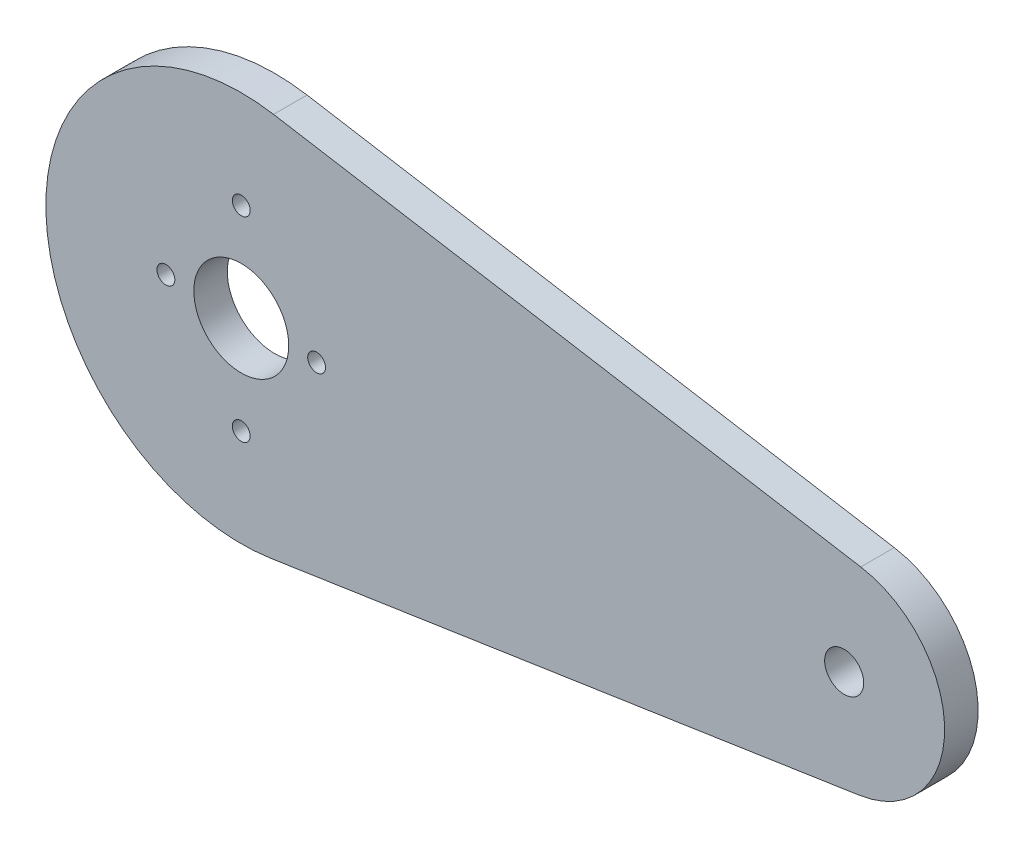
ISO-10303-21;
HEADER;
FILE_DESCRIPTION(('STEP AP214'),'2;1');
FILE_NAME('part.step','',(''),(''),'','','');
FILE_SCHEMA(('AUTOMOTIVE_DESIGN { 1 0 10303 214 1 1 1 1 }'));
ENDSEC;
DATA;
#1=APPLICATION_CONTEXT('core data for automotive mechanical design processes');
#2=APPLICATION_PROTOCOL_DEFINITION('international standard','automotive_design',2000,#1);
#3=PRODUCT_CONTEXT('',#1,'mechanical');
#4=PRODUCT('Part','Part','',(#3));
#5=PRODUCT_RELATED_PRODUCT_CATEGORY('part','',(#4));
#6=PRODUCT_DEFINITION_FORMATION('','',#4);
#7=PRODUCT_DEFINITION_CONTEXT('part definition',#1,'design');
#8=PRODUCT_DEFINITION('design','',#6,#7);
#9=PRODUCT_DEFINITION_SHAPE('','',#8);
#10=(LENGTH_UNIT() NAMED_UNIT(*) SI_UNIT(.MILLI.,.METRE.));
#11=(NAMED_UNIT(*) PLANE_ANGLE_UNIT() SI_UNIT($,.RADIAN.));
#12=(NAMED_UNIT(*) SI_UNIT($,.STERADIAN.) SOLID_ANGLE_UNIT());
#13=UNCERTAINTY_MEASURE_WITH_UNIT(LENGTH_MEASURE(1.E-05),#10,'distance_accuracy_value','');
#14=(GEOMETRIC_REPRESENTATION_CONTEXT(3) GLOBAL_UNCERTAINTY_ASSIGNED_CONTEXT((#13)) GLOBAL_UNIT_ASSIGNED_CONTEXT((#10,
#11,#12)) REPRESENTATION_CONTEXT('',''));
#15=CARTESIAN_POINT('',(0.,0.,0.));
#16=DIRECTION('',(0.,0.,1.));
#17=DIRECTION('',(1.,0.,0.));
#18=AXIS2_PLACEMENT_3D('',#15,#16,#17);
#19=CARTESIAN_POINT('',(-20.22,57.5800000000001,-3.));
#20=DIRECTION('',(0.,0.,1.));
#21=DIRECTION('',(1.,0.,0.));
#22=AXIS2_PLACEMENT_3D('',#19,#20,#21);
#23=CYLINDRICAL_SURFACE('',#22,17.4999999999997);
#24=CARTESIAN_POINT('',(-20.22,57.5800000000001,0.));
#25=DIRECTION('',(0.,0.,1.));
#26=DIRECTION('',(1.,0.,0.));
#27=AXIS2_PLACEMENT_3D('',#24,#25,#26);
#28=CIRCLE('',#27,17.4999999999997);
#29=CARTESIAN_POINT('',(-17.3295648934931,74.8396461404939,0.));
#30=VERTEX_POINT('',#29);
#31=CARTESIAN_POINT('',(-17.6013461685661,40.2770334303304,0.));
#32=VERTEX_POINT('',#31);
#33=EDGE_CURVE('E98',#30,#32,#28,.T.);
#34=ORIENTED_EDGE('',*,*,#33,.F.);
#35=DIRECTION('',(0.,0.,1.));
#36=VECTOR('',#35,1.);
#37=CARTESIAN_POINT('',(-17.3295648934931,74.8396461404939,-3.));
#38=LINE('',#37,#36);
#39=CARTESIAN_POINT('',(-17.3295648934931,74.8396461404939,-3.));
#40=VERTEX_POINT('',#39);
#41=EDGE_CURVE('E11',#40,#30,#38,.T.);
#42=ORIENTED_EDGE('',*,*,#41,.F.);
#43=CARTESIAN_POINT('',(-20.22,57.5800000000001,-3.));
#44=DIRECTION('',(0.,0.,1.));
#45=DIRECTION('',(1.,0.,0.));
#46=AXIS2_PLACEMENT_3D('',#43,#44,#45);
#47=CIRCLE('',#46,17.4999999999997);
#48=CARTESIAN_POINT('',(-17.6013461685661,40.2770334303304,-3.));
#49=VERTEX_POINT('',#48);
#50=EDGE_CURVE('E91',#40,#49,#47,.T.);
#51=ORIENTED_EDGE('',*,*,#50,.T.);
#52=DIRECTION('',(0.,0.,1.));
#53=VECTOR('',#52,1.);
#54=CARTESIAN_POINT('',(-17.6013461685661,40.2770334303304,-3.));
#55=LINE('',#54,#53);
#56=EDGE_CURVE('E36',#49,#32,#55,.T.);
#57=ORIENTED_EDGE('',*,*,#56,.T.);
#58=EDGE_LOOP('',(#34,#42,#51,#57));
#59=FACE_BOUND('',#58,.T.);
#60=ADVANCED_FACE('F33',(#59),#23,.T.);
#61=CARTESIAN_POINT('',(-17.3295648934931,74.8396461404939,-3.));
#62=DIRECTION('',(0.165167720371825,0.986265493742519,0.));
#63=DIRECTION('',(-0.986265493742519,0.165167720371825,0.));
#64=AXIS2_PLACEMENT_3D('',#61,#62,#63);
#65=PLANE('',#64);
#66=DIRECTION('',(-0.986265493742519,0.165167720371825,0.));
#67=VECTOR('',#66,1.);
#68=CARTESIAN_POINT('',(-17.3295648934931,74.8396461404939,0.));
#69=LINE('',#68,#67);
#70=CARTESIAN_POINT('',(35.2648400481839,66.0317764303149,0.));
#71=VERTEX_POINT('',#70);
#72=EDGE_CURVE('E93',#71,#30,#69,.T.);
#73=ORIENTED_EDGE('',*,*,#72,.F.);
#74=DIRECTION('',(0.,0.,1.));
#75=VECTOR('',#74,1.);
#76=CARTESIAN_POINT('',(35.2648400481839,66.0317764303149,-3.));
#77=LINE('',#76,#75);
#78=CARTESIAN_POINT('',(35.2648400481839,66.0317764303149,-3.));
#79=VERTEX_POINT('',#78);
#80=EDGE_CURVE('E42',#79,#71,#77,.T.);
#81=ORIENTED_EDGE('',*,*,#80,.F.);
#82=DIRECTION('',(-0.986265493742519,0.165167720371825,0.));
#83=VECTOR('',#82,1.);
#84=CARTESIAN_POINT('',(-17.3295648934931,74.8396461404939,-3.));
#85=LINE('',#84,#83);
#86=EDGE_CURVE('E88',#79,#40,#85,.T.);
#87=ORIENTED_EDGE('',*,*,#86,.T.);
#88=ORIENTED_EDGE('',*,*,#41,.T.);
#89=EDGE_LOOP('',(#73,#81,#87,#88));
#90=FACE_BOUND('',#89,.T.);
#91=ADVANCED_FACE('F109',(#90),#65,.T.);
#92=CARTESIAN_POINT('',(33.7783305648375,57.1553869866323,-3.));
#93=DIRECTION('',(0.,0.,1.));
#94=DIRECTION('',(1.,0.,0.));
#95=AXIS2_PLACEMENT_3D('',#92,#93,#94);
#96=CYLINDRICAL_SURFACE('',#95,8.99999999999999);
#97=CARTESIAN_POINT('',(33.7783305648375,57.1553869866323,0.));
#98=DIRECTION('',(0.,0.,1.));
#99=DIRECTION('',(-1.,0.,0.));
#100=AXIS2_PLACEMENT_3D('',#97,#98,#99);
#101=CIRCLE('',#100,8.99999999999999);
#102=CARTESIAN_POINT('',(35.1250668210035,48.2567184650877,0.));
#103=VERTEX_POINT('',#102);
#104=EDGE_CURVE('E83',#103,#71,#101,.T.);
#105=ORIENTED_EDGE('',*,*,#104,.F.);
#106=DIRECTION('',(0.,0.,1.));
#107=VECTOR('',#106,1.);
#108=CARTESIAN_POINT('',(35.1250668210035,48.2567184650877,-3.));
#109=LINE('',#108,#107);
#110=CARTESIAN_POINT('',(35.1250668210035,48.2567184650877,-3.));
#111=VERTEX_POINT('',#110);
#112=EDGE_CURVE('E78',#111,#103,#109,.T.);
#113=ORIENTED_EDGE('',*,*,#112,.F.);
#114=CARTESIAN_POINT('',(33.7783305648375,57.1553869866323,-3.));
#115=DIRECTION('',(0.,0.,1.));
#116=DIRECTION('',(-1.,0.,0.));
#117=AXIS2_PLACEMENT_3D('',#114,#115,#116);
#118=CIRCLE('',#117,8.99999999999999);
#119=EDGE_CURVE('E81',#111,#79,#118,.T.);
#120=ORIENTED_EDGE('',*,*,#119,.T.);
#121=ORIENTED_EDGE('',*,*,#80,.T.);
#122=EDGE_LOOP('',(#105,#113,#120,#121));
#123=FACE_BOUND('',#122,.T.);
#124=ADVANCED_FACE('F80',(#123),#96,.T.);
#125=CARTESIAN_POINT('',(-17.6013461685661,40.2770334303304,-3.));
#126=DIRECTION('',(0.149637361796223,-0.988740946838284,0.));
#127=DIRECTION('',(0.988740946838284,0.149637361796223,0.));
#128=AXIS2_PLACEMENT_3D('',#125,#126,#127);
#129=PLANE('',#128);
#130=DIRECTION('',(0.988740946838284,0.149637361796223,0.));
#131=VECTOR('',#130,1.);
#132=CARTESIAN_POINT('',(-17.6013461685661,40.2770334303304,0.));
#133=LINE('',#132,#131);
#134=EDGE_CURVE('E101',#32,#103,#133,.T.);
#135=ORIENTED_EDGE('',*,*,#134,.F.);
#136=ORIENTED_EDGE('',*,*,#56,.F.);
#137=DIRECTION('',(0.988740946838284,0.149637361796223,0.));
#138=VECTOR('',#137,1.);
#139=CARTESIAN_POINT('',(-17.6013461685661,40.2770334303304,-3.));
#140=LINE('',#139,#138);
#141=EDGE_CURVE('E87',#49,#111,#140,.T.);
#142=ORIENTED_EDGE('',*,*,#141,.T.);
#143=ORIENTED_EDGE('',*,*,#112,.T.);
#144=EDGE_LOOP('',(#135,#136,#142,#143));
#145=FACE_BOUND('',#144,.T.);
#146=ADVANCED_FACE('F90',(#145),#129,.T.);
#147=CARTESIAN_POINT('',(-20.22,57.5800000000001,-3.));
#148=DIRECTION('',(0.,0.,1.));
#149=DIRECTION('',(1.,0.,0.));
#150=AXIS2_PLACEMENT_3D('',#147,#148,#149);
#151=PLANE('',#150);
#152=CARTESIAN_POINT('',(-20.22,48.8300000000001,-3.));
#153=DIRECTION('',(0.,0.,1.));
#154=DIRECTION('',(1.,0.,0.));
#155=AXIS2_PLACEMENT_3D('',#152,#153,#154);
#156=CIRCLE('',#155,0.8);
#157=CARTESIAN_POINT('',(-19.42,48.8300000000001,-3.));
#158=VERTEX_POINT('',#157);
#159=EDGE_CURVE('E158',#158,#158,#156,.T.);
#160=ORIENTED_EDGE('',*,*,#159,.T.);
#161=EDGE_LOOP('',(#160));
#162=FACE_BOUND('',#161,.T.);
#163=CARTESIAN_POINT('',(-20.22,66.3300000000001,-3.));
#164=DIRECTION('',(0.,0.,1.));
#165=DIRECTION('',(1.,0.,0.));
#166=AXIS2_PLACEMENT_3D('',#163,#164,#165);
#167=CIRCLE('',#166,0.799999999999998);
#168=CARTESIAN_POINT('',(-19.42,66.3300000000001,-3.));
#169=VERTEX_POINT('',#168);
#170=EDGE_CURVE('E166',#169,#169,#167,.T.);
#171=ORIENTED_EDGE('',*,*,#170,.T.);
#172=EDGE_LOOP('',(#171));
#173=FACE_BOUND('',#172,.T.);
#174=CARTESIAN_POINT('',(-26.97,57.5800000000001,-3.));
#175=DIRECTION('',(0.,0.,1.));
#176=DIRECTION('',(1.,0.,0.));
#177=AXIS2_PLACEMENT_3D('',#174,#175,#176);
#178=CIRCLE('',#177,0.8);
#179=CARTESIAN_POINT('',(-26.17,57.5800000000001,-3.));
#180=VERTEX_POINT('',#179);
#181=EDGE_CURVE('E172',#180,#180,#178,.T.);
#182=ORIENTED_EDGE('',*,*,#181,.T.);
#183=EDGE_LOOP('',(#182));
#184=FACE_BOUND('',#183,.T.);
#185=CARTESIAN_POINT('',(-13.47,57.5269217323897,-3.));
#186=DIRECTION('',(0.,0.,1.));
#187=DIRECTION('',(1.,0.,0.));
#188=AXIS2_PLACEMENT_3D('',#185,#186,#187);
#189=CIRCLE('',#188,0.800000000000003);
#190=CARTESIAN_POINT('',(-12.67,57.5269217323897,-3.));
#191=VERTEX_POINT('',#190);
#192=EDGE_CURVE('E178',#191,#191,#189,.T.);
#193=ORIENTED_EDGE('',*,*,#192,.T.);
#194=EDGE_LOOP('',(#193));
#195=FACE_BOUND('',#194,.T.);
#196=CARTESIAN_POINT('',(-20.22,57.5800000000001,-3.));
#197=DIRECTION('',(0.,0.,1.));
#198=DIRECTION('',(1.,0.,0.));
#199=AXIS2_PLACEMENT_3D('',#196,#197,#198);
#200=CIRCLE('',#199,4.25);
#201=CARTESIAN_POINT('',(-15.97,57.5800000000001,-3.));
#202=VERTEX_POINT('',#201);
#203=EDGE_CURVE('E184',#202,#202,#200,.T.);
#204=ORIENTED_EDGE('',*,*,#203,.T.);
#205=EDGE_LOOP('',(#204));
#206=FACE_BOUND('',#205,.T.);
#207=CARTESIAN_POINT('',(33.7783305648375,57.1553869866323,-3.));
#208=DIRECTION('',(0.,0.,1.));
#209=DIRECTION('',(1.,0.,0.));
#210=AXIS2_PLACEMENT_3D('',#207,#208,#209);
#211=CIRCLE('',#210,1.75);
#212=CARTESIAN_POINT('',(35.5283305648375,57.1553869866323,-3.));
#213=VERTEX_POINT('',#212);
#214=EDGE_CURVE('E102',#213,#213,#211,.T.);
#215=ORIENTED_EDGE('',*,*,#214,.T.);
#216=EDGE_LOOP('',(#215));
#217=FACE_BOUND('',#216,.T.);
#218=ORIENTED_EDGE('',*,*,#50,.F.);
#219=ORIENTED_EDGE('',*,*,#86,.F.);
#220=ORIENTED_EDGE('',*,*,#119,.F.);
#221=ORIENTED_EDGE('',*,*,#141,.F.);
#222=EDGE_LOOP('',(#218,#219,#220,#221));
#223=FACE_BOUND('',#222,.T.);
#224=ADVANCED_FACE('F86',(#162,#173,#184,#195,#206,#217,#223),#151,.F.);
#225=CARTESIAN_POINT('',(-20.22,57.5800000000001,0.));
#226=DIRECTION('',(0.,0.,1.));
#227=DIRECTION('',(1.,0.,0.));
#228=AXIS2_PLACEMENT_3D('',#225,#226,#227);
#229=PLANE('',#228);
#230=CARTESIAN_POINT('',(-20.22,48.8300000000001,0.));
#231=DIRECTION('',(0.,0.,1.));
#232=DIRECTION('',(1.,0.,0.));
#233=AXIS2_PLACEMENT_3D('',#230,#231,#232);
#234=CIRCLE('',#233,0.8);
#235=CARTESIAN_POINT('',(-19.42,48.8300000000001,0.));
#236=VERTEX_POINT('',#235);
#237=EDGE_CURVE('E161',#236,#236,#234,.T.);
#238=ORIENTED_EDGE('',*,*,#237,.F.);
#239=EDGE_LOOP('',(#238));
#240=FACE_BOUND('',#239,.T.);
#241=CARTESIAN_POINT('',(-20.22,66.3300000000001,0.));
#242=DIRECTION('',(0.,0.,1.));
#243=DIRECTION('',(1.,0.,0.));
#244=AXIS2_PLACEMENT_3D('',#241,#242,#243);
#245=CIRCLE('',#244,0.799999999999998);
#246=CARTESIAN_POINT('',(-19.42,66.3300000000001,0.));
#247=VERTEX_POINT('',#246);
#248=EDGE_CURVE('E163',#247,#247,#245,.T.);
#249=ORIENTED_EDGE('',*,*,#248,.F.);
#250=EDGE_LOOP('',(#249));
#251=FACE_BOUND('',#250,.T.);
#252=CARTESIAN_POINT('',(-26.97,57.5800000000001,0.));
#253=DIRECTION('',(0.,0.,1.));
#254=DIRECTION('',(1.,0.,0.));
#255=AXIS2_PLACEMENT_3D('',#252,#253,#254);
#256=CIRCLE('',#255,0.8);
#257=CARTESIAN_POINT('',(-26.17,57.5800000000001,0.));
#258=VERTEX_POINT('',#257);
#259=EDGE_CURVE('E169',#258,#258,#256,.T.);
#260=ORIENTED_EDGE('',*,*,#259,.F.);
#261=EDGE_LOOP('',(#260));
#262=FACE_BOUND('',#261,.T.);
#263=CARTESIAN_POINT('',(-13.47,57.5269217323897,0.));
#264=DIRECTION('',(0.,0.,1.));
#265=DIRECTION('',(1.,0.,0.));
#266=AXIS2_PLACEMENT_3D('',#263,#264,#265);
#267=CIRCLE('',#266,0.800000000000003);
#268=CARTESIAN_POINT('',(-12.67,57.5269217323897,0.));
#269=VERTEX_POINT('',#268);
#270=EDGE_CURVE('E175',#269,#269,#267,.T.);
#271=ORIENTED_EDGE('',*,*,#270,.F.);
#272=EDGE_LOOP('',(#271));
#273=FACE_BOUND('',#272,.T.);
#274=CARTESIAN_POINT('',(-20.22,57.5800000000001,0.));
#275=DIRECTION('',(0.,0.,1.));
#276=DIRECTION('',(1.,0.,0.));
#277=AXIS2_PLACEMENT_3D('',#274,#275,#276);
#278=CIRCLE('',#277,4.25);
#279=CARTESIAN_POINT('',(-15.97,57.5800000000001,0.));
#280=VERTEX_POINT('',#279);
#281=EDGE_CURVE('E181',#280,#280,#278,.T.);
#282=ORIENTED_EDGE('',*,*,#281,.F.);
#283=EDGE_LOOP('',(#282));
#284=FACE_BOUND('',#283,.T.);
#285=CARTESIAN_POINT('',(33.7783305648375,57.1553869866323,0.));
#286=DIRECTION('',(0.,0.,1.));
#287=DIRECTION('',(1.,0.,0.));
#288=AXIS2_PLACEMENT_3D('',#285,#286,#287);
#289=CIRCLE('',#288,1.75);
#290=CARTESIAN_POINT('',(35.5283305648375,57.1553869866323,0.));
#291=VERTEX_POINT('',#290);
#292=EDGE_CURVE('E187',#291,#291,#289,.T.);
#293=ORIENTED_EDGE('',*,*,#292,.F.);
#294=EDGE_LOOP('',(#293));
#295=FACE_BOUND('',#294,.T.);
#296=ORIENTED_EDGE('',*,*,#33,.T.);
#297=ORIENTED_EDGE('',*,*,#134,.T.);
#298=ORIENTED_EDGE('',*,*,#104,.T.);
#299=ORIENTED_EDGE('',*,*,#72,.T.);
#300=EDGE_LOOP('',(#296,#297,#298,#299));
#301=FACE_BOUND('',#300,.T.);
#302=ADVANCED_FACE('F108',(#240,#251,#262,#273,#284,#295,#301),#229,.T.);
#303=CARTESIAN_POINT('',(33.7783305648375,57.1553869866323,-3.));
#304=DIRECTION('',(0.,0.,1.));
#305=DIRECTION('',(1.,0.,0.));
#306=AXIS2_PLACEMENT_3D('',#303,#304,#305);
#307=CYLINDRICAL_SURFACE('',#306,1.75);
#308=ORIENTED_EDGE('',*,*,#214,.F.);
#309=EDGE_LOOP('',(#308));
#310=FACE_BOUND('',#309,.T.);
#311=ORIENTED_EDGE('',*,*,#292,.T.);
#312=EDGE_LOOP('',(#311));
#313=FACE_BOUND('',#312,.T.);
#314=ADVANCED_FACE('F127',(#310,#313),#307,.F.);
#315=CARTESIAN_POINT('',(-20.22,57.5800000000001,-3.));
#316=DIRECTION('',(0.,0.,1.));
#317=DIRECTION('',(1.,0.,0.));
#318=AXIS2_PLACEMENT_3D('',#315,#316,#317);
#319=CYLINDRICAL_SURFACE('',#318,4.25);
#320=ORIENTED_EDGE('',*,*,#203,.F.);
#321=EDGE_LOOP('',(#320));
#322=FACE_BOUND('',#321,.T.);
#323=ORIENTED_EDGE('',*,*,#281,.T.);
#324=EDGE_LOOP('',(#323));
#325=FACE_BOUND('',#324,.T.);
#326=ADVANCED_FACE('F134',(#322,#325),#319,.F.);
#327=CARTESIAN_POINT('',(-13.47,57.5269217323897,-3.));
#328=DIRECTION('',(0.,0.,1.));
#329=DIRECTION('',(1.,0.,0.));
#330=AXIS2_PLACEMENT_3D('',#327,#328,#329);
#331=CYLINDRICAL_SURFACE('',#330,0.800000000000003);
#332=ORIENTED_EDGE('',*,*,#192,.F.);
#333=EDGE_LOOP('',(#332));
#334=FACE_BOUND('',#333,.T.);
#335=ORIENTED_EDGE('',*,*,#270,.T.);
#336=EDGE_LOOP('',(#335));
#337=FACE_BOUND('',#336,.T.);
#338=ADVANCED_FACE('F138',(#334,#337),#331,.F.);
#339=CARTESIAN_POINT('',(-26.97,57.5800000000001,-3.));
#340=DIRECTION('',(0.,0.,1.));
#341=DIRECTION('',(1.,0.,0.));
#342=AXIS2_PLACEMENT_3D('',#339,#340,#341);
#343=CYLINDRICAL_SURFACE('',#342,0.8);
#344=ORIENTED_EDGE('',*,*,#181,.F.);
#345=EDGE_LOOP('',(#344));
#346=FACE_BOUND('',#345,.T.);
#347=ORIENTED_EDGE('',*,*,#259,.T.);
#348=EDGE_LOOP('',(#347));
#349=FACE_BOUND('',#348,.T.);
#350=ADVANCED_FACE('F142',(#346,#349),#343,.F.);
#351=CARTESIAN_POINT('',(-20.22,66.3300000000001,-3.));
#352=DIRECTION('',(0.,0.,1.));
#353=DIRECTION('',(1.,0.,0.));
#354=AXIS2_PLACEMENT_3D('',#351,#352,#353);
#355=CYLINDRICAL_SURFACE('',#354,0.799999999999998);
#356=ORIENTED_EDGE('',*,*,#170,.F.);
#357=EDGE_LOOP('',(#356));
#358=FACE_BOUND('',#357,.T.);
#359=ORIENTED_EDGE('',*,*,#248,.T.);
#360=EDGE_LOOP('',(#359));
#361=FACE_BOUND('',#360,.T.);
#362=ADVANCED_FACE('F146',(#358,#361),#355,.F.);
#363=CARTESIAN_POINT('',(-20.22,48.8300000000001,-3.));
#364=DIRECTION('',(0.,0.,1.));
#365=DIRECTION('',(1.,0.,0.));
#366=AXIS2_PLACEMENT_3D('',#363,#364,#365);
#367=CYLINDRICAL_SURFACE('',#366,0.8);
#368=ORIENTED_EDGE('',*,*,#159,.F.);
#369=EDGE_LOOP('',(#368));
#370=FACE_BOUND('',#369,.T.);
#371=ORIENTED_EDGE('',*,*,#237,.T.);
#372=EDGE_LOOP('',(#371));
#373=FACE_BOUND('',#372,.T.);
#374=ADVANCED_FACE('F150',(#370,#373),#367,.F.);
#375=CLOSED_SHELL('',(#60,#91,#124,#146,#224,#302,#314,#326,#338,#350,#362,#374));
#376=MANIFOLD_SOLID_BREP('B2',#375);
#377=ADVANCED_BREP_SHAPE_REPRESENTATION('',(#18,#376),#14);
#378=SHAPE_DEFINITION_REPRESENTATION(#9,#377);
ENDSEC;
END-ISO-10303-21;
